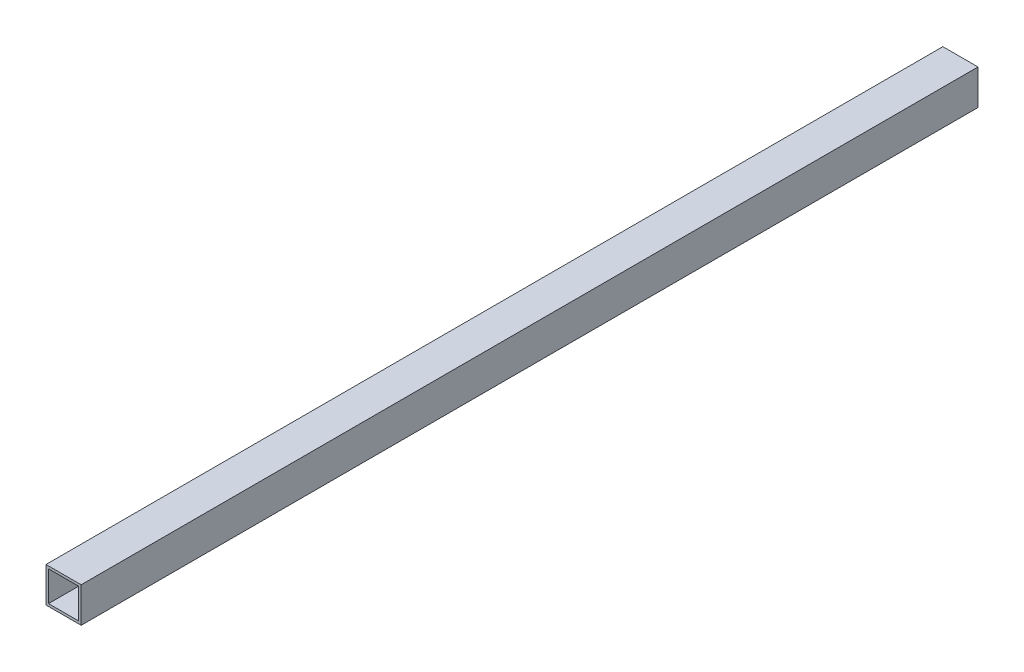
ISO-10303-21;
HEADER;
FILE_DESCRIPTION(('STEP AP214'),'2;1');
FILE_NAME('part.step','',(''),(''),'','','');
FILE_SCHEMA(('AUTOMOTIVE_DESIGN { 1 0 10303 214 1 1 1 1 }'));
ENDSEC;
DATA;
#1=APPLICATION_CONTEXT('core data for automotive mechanical design processes');
#2=APPLICATION_PROTOCOL_DEFINITION('international standard','automotive_design',2000,#1);
#3=PRODUCT_CONTEXT('',#1,'mechanical');
#4=PRODUCT('Part','Part','',(#3));
#5=PRODUCT_RELATED_PRODUCT_CATEGORY('part','',(#4));
#6=PRODUCT_DEFINITION_FORMATION('','',#4);
#7=PRODUCT_DEFINITION_CONTEXT('part definition',#1,'design');
#8=PRODUCT_DEFINITION('design','',#6,#7);
#9=PRODUCT_DEFINITION_SHAPE('','',#8);
#10=(LENGTH_UNIT() NAMED_UNIT(*) SI_UNIT(.MILLI.,.METRE.));
#11=(NAMED_UNIT(*) PLANE_ANGLE_UNIT() SI_UNIT($,.RADIAN.));
#12=(NAMED_UNIT(*) SI_UNIT($,.STERADIAN.) SOLID_ANGLE_UNIT());
#13=UNCERTAINTY_MEASURE_WITH_UNIT(LENGTH_MEASURE(1.E-05),#10,'distance_accuracy_value','');
#14=(GEOMETRIC_REPRESENTATION_CONTEXT(3) GLOBAL_UNCERTAINTY_ASSIGNED_CONTEXT((#13)) GLOBAL_UNIT_ASSIGNED_CONTEXT((#10,
#11,#12)) REPRESENTATION_CONTEXT('',''));
#15=CARTESIAN_POINT('',(0.,0.,0.));
#16=DIRECTION('',(0.,0.,1.));
#17=DIRECTION('',(1.,0.,0.));
#18=AXIS2_PLACEMENT_3D('',#15,#16,#17);
#19=CARTESIAN_POINT('',(44.45,44.45,0.));
#20=DIRECTION('',(0.,1.,0.));
#21=DIRECTION('',(0.,0.,1.));
#22=AXIS2_PLACEMENT_3D('',#19,#20,#21);
#23=PLANE('',#22);
#24=DIRECTION('',(0.,0.,-1.));
#25=VECTOR('',#24,1.);
#26=CARTESIAN_POINT('',(44.45,44.45,0.));
#27=LINE('',#26,#25);
#28=CARTESIAN_POINT('',(44.45,44.45,0.));
#29=VERTEX_POINT('',#28);
#30=CARTESIAN_POINT('',(44.45,44.45,1134.364));
#31=VERTEX_POINT('',#30);
#32=EDGE_CURVE('E114',#29,#31,#27,.F.);
#33=ORIENTED_EDGE('',*,*,#32,.F.);
#34=DIRECTION('',(1.,0.,0.));
#35=VECTOR('',#34,1.);
#36=CARTESIAN_POINT('',(0.,44.45,0.));
#37=LINE('',#36,#35);
#38=CARTESIAN_POINT('',(0.,44.45,0.));
#39=VERTEX_POINT('',#38);
#40=EDGE_CURVE('E136',#29,#39,#37,.F.);
#41=ORIENTED_EDGE('',*,*,#40,.T.);
#42=DIRECTION('',(0.,0.,1.));
#43=VECTOR('',#42,1.);
#44=CARTESIAN_POINT('',(0.,44.45,0.));
#45=LINE('',#44,#43);
#46=CARTESIAN_POINT('',(0.,44.45,1134.364));
#47=VERTEX_POINT('',#46);
#48=EDGE_CURVE('E131',#47,#39,#45,.F.);
#49=ORIENTED_EDGE('',*,*,#48,.F.);
#50=DIRECTION('',(1.,0.,0.));
#51=VECTOR('',#50,1.);
#52=CARTESIAN_POINT('',(0.,44.45,1134.364));
#53=LINE('',#52,#51);
#54=EDGE_CURVE('E106',#31,#47,#53,.F.);
#55=ORIENTED_EDGE('',*,*,#54,.F.);
#56=EDGE_LOOP('',(#33,#41,#49,#55));
#57=FACE_BOUND('',#56,.T.);
#58=ADVANCED_FACE('F17',(#57),#23,.T.);
#59=CARTESIAN_POINT('',(41.275,41.275,0.));
#60=DIRECTION('',(-1.,0.,0.));
#61=DIRECTION('',(0.,0.,1.));
#62=AXIS2_PLACEMENT_3D('',#59,#60,#61);
#63=PLANE('',#62);
#64=DIRECTION('',(0.,0.,-1.));
#65=VECTOR('',#64,1.);
#66=CARTESIAN_POINT('',(41.275,41.275,0.));
#67=LINE('',#66,#65);
#68=CARTESIAN_POINT('',(41.275,41.275,0.));
#69=VERTEX_POINT('',#68);
#70=CARTESIAN_POINT('',(41.275,41.275,1134.364));
#71=VERTEX_POINT('',#70);
#72=EDGE_CURVE('E91',#69,#71,#67,.F.);
#73=ORIENTED_EDGE('',*,*,#72,.F.);
#74=DIRECTION('',(0.,1.,0.));
#75=VECTOR('',#74,1.);
#76=CARTESIAN_POINT('',(41.275,0.,0.));
#77=LINE('',#76,#75);
#78=CARTESIAN_POINT('',(41.275,3.175,0.));
#79=VERTEX_POINT('',#78);
#80=EDGE_CURVE('E139',#69,#79,#77,.F.);
#81=ORIENTED_EDGE('',*,*,#80,.T.);
#82=DIRECTION('',(0.,0.,1.));
#83=VECTOR('',#82,1.);
#84=CARTESIAN_POINT('',(41.275,3.175,0.));
#85=LINE('',#84,#83);
#86=CARTESIAN_POINT('',(41.275,3.175,1134.364));
#87=VERTEX_POINT('',#86);
#88=EDGE_CURVE('E20',#87,#79,#85,.F.);
#89=ORIENTED_EDGE('',*,*,#88,.F.);
#90=DIRECTION('',(0.,1.,0.));
#91=VECTOR('',#90,1.);
#92=CARTESIAN_POINT('',(41.275,0.,1134.364));
#93=LINE('',#92,#91);
#94=EDGE_CURVE('E105',#71,#87,#93,.F.);
#95=ORIENTED_EDGE('',*,*,#94,.F.);
#96=EDGE_LOOP('',(#73,#81,#89,#95));
#97=FACE_BOUND('',#96,.T.);
#98=ADVANCED_FACE('F125',(#97),#63,.T.);
#99=CARTESIAN_POINT('',(41.275,3.175,0.));
#100=DIRECTION('',(0.,1.,0.));
#101=DIRECTION('',(0.,0.,1.));
#102=AXIS2_PLACEMENT_3D('',#99,#100,#101);
#103=PLANE('',#102);
#104=ORIENTED_EDGE('',*,*,#88,.T.);
#105=DIRECTION('',(1.,0.,0.));
#106=VECTOR('',#105,1.);
#107=CARTESIAN_POINT('',(0.,3.175,0.));
#108=LINE('',#107,#106);
#109=CARTESIAN_POINT('',(3.175,3.175,0.));
#110=VERTEX_POINT('',#109);
#111=EDGE_CURVE('E88',#79,#110,#108,.F.);
#112=ORIENTED_EDGE('',*,*,#111,.T.);
#113=DIRECTION('',(0.,0.,-1.));
#114=VECTOR('',#113,1.);
#115=CARTESIAN_POINT('',(3.175,3.175,0.));
#116=LINE('',#115,#114);
#117=CARTESIAN_POINT('',(3.175,3.175,1134.364));
#118=VERTEX_POINT('',#117);
#119=EDGE_CURVE('E80',#118,#110,#116,.T.);
#120=ORIENTED_EDGE('',*,*,#119,.F.);
#121=DIRECTION('',(1.,0.,0.));
#122=VECTOR('',#121,1.);
#123=CARTESIAN_POINT('',(0.,3.175,1134.364));
#124=LINE('',#123,#122);
#125=EDGE_CURVE('E85',#87,#118,#124,.F.);
#126=ORIENTED_EDGE('',*,*,#125,.F.);
#127=EDGE_LOOP('',(#104,#112,#120,#126));
#128=FACE_BOUND('',#127,.T.);
#129=ADVANCED_FACE('F83',(#128),#103,.T.);
#130=CARTESIAN_POINT('',(3.175,3.175,0.));
#131=DIRECTION('',(1.,0.,0.));
#132=DIRECTION('',(0.,0.,-1.));
#133=AXIS2_PLACEMENT_3D('',#130,#131,#132);
#134=PLANE('',#133);
#135=ORIENTED_EDGE('',*,*,#119,.T.);
#136=DIRECTION('',(0.,1.,0.));
#137=VECTOR('',#136,1.);
#138=CARTESIAN_POINT('',(3.175,0.,0.));
#139=LINE('',#138,#137);
#140=CARTESIAN_POINT('',(3.175,41.275,0.));
#141=VERTEX_POINT('',#140);
#142=EDGE_CURVE('E142',#110,#141,#139,.T.);
#143=ORIENTED_EDGE('',*,*,#142,.T.);
#144=DIRECTION('',(0.,0.,-1.));
#145=VECTOR('',#144,1.);
#146=CARTESIAN_POINT('',(3.175,41.275,0.));
#147=LINE('',#146,#145);
#148=CARTESIAN_POINT('',(3.175,41.275,1134.364));
#149=VERTEX_POINT('',#148);
#150=EDGE_CURVE('E96',#149,#141,#147,.T.);
#151=ORIENTED_EDGE('',*,*,#150,.F.);
#152=DIRECTION('',(0.,1.,0.));
#153=VECTOR('',#152,1.);
#154=CARTESIAN_POINT('',(3.175,0.,1134.364));
#155=LINE('',#154,#153);
#156=EDGE_CURVE('E93',#118,#149,#155,.T.);
#157=ORIENTED_EDGE('',*,*,#156,.F.);
#158=EDGE_LOOP('',(#135,#143,#151,#157));
#159=FACE_BOUND('',#158,.T.);
#160=ADVANCED_FACE('F94',(#159),#134,.T.);
#161=CARTESIAN_POINT('',(3.175,41.275,0.));
#162=DIRECTION('',(0.,-1.,0.));
#163=DIRECTION('',(0.,0.,-1.));
#164=AXIS2_PLACEMENT_3D('',#161,#162,#163);
#165=PLANE('',#164);
#166=ORIENTED_EDGE('',*,*,#150,.T.);
#167=DIRECTION('',(1.,0.,0.));
#168=VECTOR('',#167,1.);
#169=CARTESIAN_POINT('',(0.,41.275,0.));
#170=LINE('',#169,#168);
#171=EDGE_CURVE('E122',#141,#69,#170,.T.);
#172=ORIENTED_EDGE('',*,*,#171,.T.);
#173=ORIENTED_EDGE('',*,*,#72,.T.);
#174=DIRECTION('',(1.,0.,0.));
#175=VECTOR('',#174,1.);
#176=CARTESIAN_POINT('',(0.,41.275,1134.364));
#177=LINE('',#176,#175);
#178=EDGE_CURVE('E100',#149,#71,#177,.T.);
#179=ORIENTED_EDGE('',*,*,#178,.F.);
#180=EDGE_LOOP('',(#166,#172,#173,#179));
#181=FACE_BOUND('',#180,.T.);
#182=ADVANCED_FACE('F120',(#181),#165,.T.);
#183=CARTESIAN_POINT('',(44.45,0.,0.));
#184=DIRECTION('',(1.,0.,0.));
#185=DIRECTION('',(0.,0.,-1.));
#186=AXIS2_PLACEMENT_3D('',#183,#184,#185);
#187=PLANE('',#186);
#188=DIRECTION('',(0.,0.,-1.));
#189=VECTOR('',#188,1.);
#190=CARTESIAN_POINT('',(44.45,0.,0.));
#191=LINE('',#190,#189);
#192=CARTESIAN_POINT('',(44.45,0.,0.));
#193=VERTEX_POINT('',#192);
#194=CARTESIAN_POINT('',(44.45,0.,1134.364));
#195=VERTEX_POINT('',#194);
#196=EDGE_CURVE('E145',#193,#195,#191,.F.);
#197=ORIENTED_EDGE('',*,*,#196,.F.);
#198=DIRECTION('',(0.,1.,0.));
#199=VECTOR('',#198,1.);
#200=CARTESIAN_POINT('',(44.45,0.,0.));
#201=LINE('',#200,#199);
#202=EDGE_CURVE('E133',#193,#29,#201,.T.);
#203=ORIENTED_EDGE('',*,*,#202,.T.);
#204=ORIENTED_EDGE('',*,*,#32,.T.);
#205=DIRECTION('',(0.,1.,0.));
#206=VECTOR('',#205,1.);
#207=CARTESIAN_POINT('',(44.45,0.,1134.364));
#208=LINE('',#207,#206);
#209=EDGE_CURVE('E108',#195,#31,#208,.T.);
#210=ORIENTED_EDGE('',*,*,#209,.F.);
#211=EDGE_LOOP('',(#197,#203,#204,#210));
#212=FACE_BOUND('',#211,.T.);
#213=ADVANCED_FACE('F164',(#212),#187,.T.);
#214=CARTESIAN_POINT('',(0.,0.,1134.364));
#215=DIRECTION('',(0.,0.,1.));
#216=DIRECTION('',(1.,0.,0.));
#217=AXIS2_PLACEMENT_3D('',#214,#215,#216);
#218=PLANE('',#217);
#219=ORIENTED_EDGE('',*,*,#178,.T.);
#220=ORIENTED_EDGE('',*,*,#94,.T.);
#221=ORIENTED_EDGE('',*,*,#125,.T.);
#222=ORIENTED_EDGE('',*,*,#156,.T.);
#223=EDGE_LOOP('',(#219,#220,#221,#222));
#224=FACE_BOUND('',#223,.T.);
#225=DIRECTION('',(0.,1.,0.));
#226=VECTOR('',#225,1.);
#227=CARTESIAN_POINT('',(0.,44.45,1134.364));
#228=LINE('',#227,#226);
#229=CARTESIAN_POINT('',(0.,0.,1134.364));
#230=VERTEX_POINT('',#229);
#231=EDGE_CURVE('E126',#230,#47,#228,.T.);
#232=ORIENTED_EDGE('',*,*,#231,.F.);
#233=DIRECTION('',(1.,0.,0.));
#234=VECTOR('',#233,1.);
#235=CARTESIAN_POINT('',(0.,0.,1134.364));
#236=LINE('',#235,#234);
#237=EDGE_CURVE('E148',#195,#230,#236,.F.);
#238=ORIENTED_EDGE('',*,*,#237,.F.);
#239=ORIENTED_EDGE('',*,*,#209,.T.);
#240=ORIENTED_EDGE('',*,*,#54,.T.);
#241=EDGE_LOOP('',(#232,#238,#239,#240));
#242=FACE_BOUND('',#241,.T.);
#243=ADVANCED_FACE('F102',(#224,#242),#218,.T.);
#244=CARTESIAN_POINT('',(0.,44.45,0.));
#245=DIRECTION('',(-1.,0.,0.));
#246=DIRECTION('',(0.,0.,1.));
#247=AXIS2_PLACEMENT_3D('',#244,#245,#246);
#248=PLANE('',#247);
#249=ORIENTED_EDGE('',*,*,#48,.T.);
#250=DIRECTION('',(0.,1.,0.));
#251=VECTOR('',#250,1.);
#252=CARTESIAN_POINT('',(0.,0.,0.));
#253=LINE('',#252,#251);
#254=CARTESIAN_POINT('',(0.,0.,0.));
#255=VERTEX_POINT('',#254);
#256=EDGE_CURVE('E35',#39,#255,#253,.F.);
#257=ORIENTED_EDGE('',*,*,#256,.T.);
#258=DIRECTION('',(0.,0.,-1.));
#259=VECTOR('',#258,1.);
#260=CARTESIAN_POINT('',(0.,0.,0.));
#261=LINE('',#260,#259);
#262=EDGE_CURVE('E26',#230,#255,#261,.T.);
#263=ORIENTED_EDGE('',*,*,#262,.F.);
#264=ORIENTED_EDGE('',*,*,#231,.T.);
#265=EDGE_LOOP('',(#249,#257,#263,#264));
#266=FACE_BOUND('',#265,.T.);
#267=ADVANCED_FACE('F155',(#266),#248,.T.);
#268=CARTESIAN_POINT('',(0.,0.,0.));
#269=DIRECTION('',(0.,0.,1.));
#270=DIRECTION('',(1.,0.,0.));
#271=AXIS2_PLACEMENT_3D('',#268,#269,#270);
#272=PLANE('',#271);
#273=ORIENTED_EDGE('',*,*,#142,.F.);
#274=ORIENTED_EDGE('',*,*,#111,.F.);
#275=ORIENTED_EDGE('',*,*,#80,.F.);
#276=ORIENTED_EDGE('',*,*,#171,.F.);
#277=EDGE_LOOP('',(#273,#274,#275,#276));
#278=FACE_BOUND('',#277,.T.);
#279=ORIENTED_EDGE('',*,*,#40,.F.);
#280=ORIENTED_EDGE('',*,*,#202,.F.);
#281=DIRECTION('',(1.,0.,0.));
#282=VECTOR('',#281,1.);
#283=CARTESIAN_POINT('',(0.,0.,0.));
#284=LINE('',#283,#282);
#285=EDGE_CURVE('E11',#255,#193,#284,.T.);
#286=ORIENTED_EDGE('',*,*,#285,.F.);
#287=ORIENTED_EDGE('',*,*,#256,.F.);
#288=EDGE_LOOP('',(#279,#280,#286,#287));
#289=FACE_BOUND('',#288,.T.);
#290=ADVANCED_FACE('F162',(#278,#289),#272,.F.);
#291=CARTESIAN_POINT('',(0.,0.,0.));
#292=DIRECTION('',(0.,-1.,0.));
#293=DIRECTION('',(0.,0.,-1.));
#294=AXIS2_PLACEMENT_3D('',#291,#292,#293);
#295=PLANE('',#294);
#296=ORIENTED_EDGE('',*,*,#262,.T.);
#297=ORIENTED_EDGE('',*,*,#285,.T.);
#298=ORIENTED_EDGE('',*,*,#196,.T.);
#299=ORIENTED_EDGE('',*,*,#237,.T.);
#300=EDGE_LOOP('',(#296,#297,#298,#299));
#301=FACE_BOUND('',#300,.T.);
#302=ADVANCED_FACE('F153',(#301),#295,.T.);
#303=CLOSED_SHELL('',(#58,#98,#129,#160,#182,#213,#243,#267,#290,#302));
#304=MANIFOLD_SOLID_BREP('B1',#303);
#305=ADVANCED_BREP_SHAPE_REPRESENTATION('',(#18,#304),#14);
#306=SHAPE_DEFINITION_REPRESENTATION(#9,#305);
ENDSEC;
END-ISO-10303-21;
